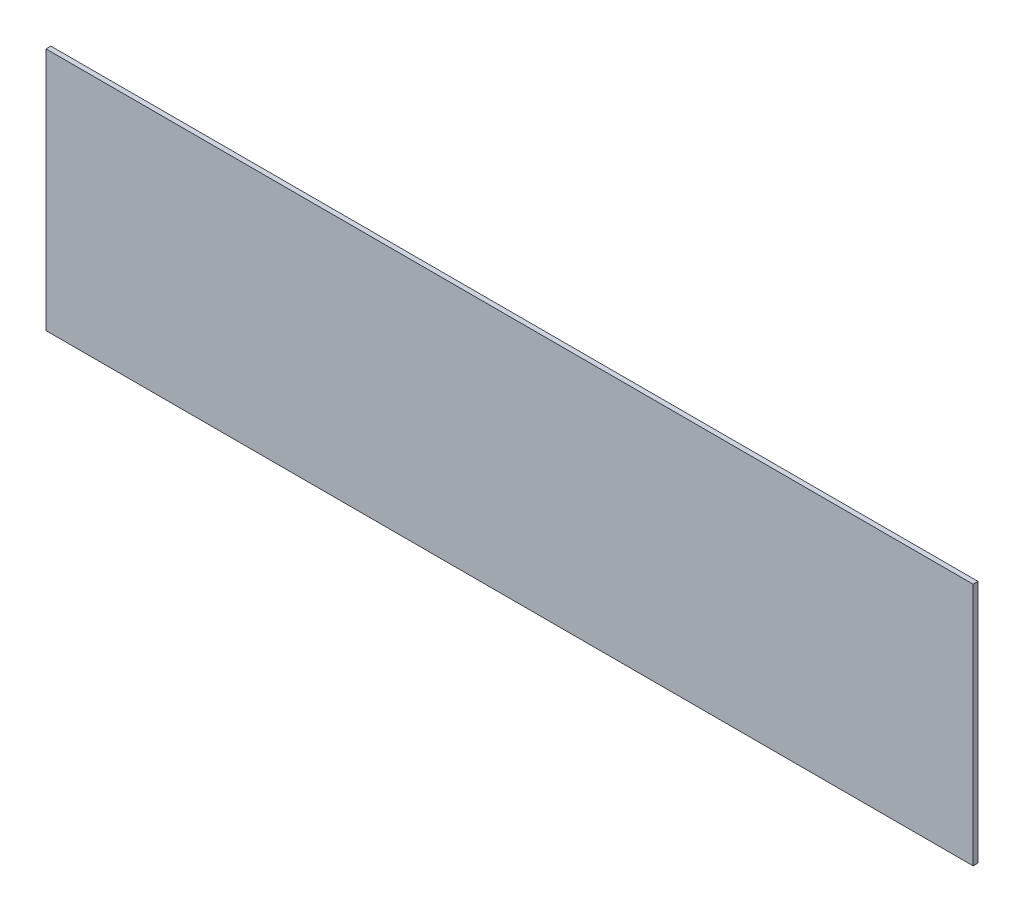
ISO-10303-21;
HEADER;
FILE_DESCRIPTION(('STEP AP214'),'2;1');
FILE_NAME('part.step','',(''),(''),'','','');
FILE_SCHEMA(('AUTOMOTIVE_DESIGN { 1 0 10303 214 1 1 1 1 }'));
ENDSEC;
DATA;
#1=APPLICATION_CONTEXT('core data for automotive mechanical design processes');
#2=APPLICATION_PROTOCOL_DEFINITION('international standard','automotive_design',2000,#1);
#3=PRODUCT_CONTEXT('',#1,'mechanical');
#4=PRODUCT('Part','Part','',(#3));
#5=PRODUCT_RELATED_PRODUCT_CATEGORY('part','',(#4));
#6=PRODUCT_DEFINITION_FORMATION('','',#4);
#7=PRODUCT_DEFINITION_CONTEXT('part definition',#1,'design');
#8=PRODUCT_DEFINITION('design','',#6,#7);
#9=PRODUCT_DEFINITION_SHAPE('','',#8);
#10=(LENGTH_UNIT() NAMED_UNIT(*) SI_UNIT(.MILLI.,.METRE.));
#11=(NAMED_UNIT(*) PLANE_ANGLE_UNIT() SI_UNIT($,.RADIAN.));
#12=(NAMED_UNIT(*) SI_UNIT($,.STERADIAN.) SOLID_ANGLE_UNIT());
#13=UNCERTAINTY_MEASURE_WITH_UNIT(LENGTH_MEASURE(1.E-05),#10,'distance_accuracy_value','');
#14=(GEOMETRIC_REPRESENTATION_CONTEXT(3) GLOBAL_UNCERTAINTY_ASSIGNED_CONTEXT((#13)) GLOBAL_UNIT_ASSIGNED_CONTEXT((#10,
#11,#12)) REPRESENTATION_CONTEXT('',''));
#15=CARTESIAN_POINT('',(0.,0.,0.));
#16=DIRECTION('',(0.,0.,1.));
#17=DIRECTION('',(1.,0.,0.));
#18=AXIS2_PLACEMENT_3D('',#15,#16,#17);
#19=CARTESIAN_POINT('',(285.,75.,3.));
#20=DIRECTION('',(-1.,0.,0.));
#21=DIRECTION('',(0.,-1.,0.));
#22=AXIS2_PLACEMENT_3D('',#19,#20,#21);
#23=PLANE('',#22);
#24=DIRECTION('',(0.,1.,0.));
#25=VECTOR('',#24,1.);
#26=CARTESIAN_POINT('',(285.,75.,0.));
#27=LINE('',#26,#25);
#28=CARTESIAN_POINT('',(285.,-75.,0.));
#29=VERTEX_POINT('',#28);
#30=CARTESIAN_POINT('',(285.,75.,0.));
#31=VERTEX_POINT('',#30);
#32=EDGE_CURVE('E95',#29,#31,#27,.T.);
#33=ORIENTED_EDGE('',*,*,#32,.T.);
#34=DIRECTION('',(0.,0.,-1.));
#35=VECTOR('',#34,1.);
#36=CARTESIAN_POINT('',(285.,75.,3.));
#37=LINE('',#36,#35);
#38=CARTESIAN_POINT('',(285.,75.,3.));
#39=VERTEX_POINT('',#38);
#40=EDGE_CURVE('E11',#39,#31,#37,.T.);
#41=ORIENTED_EDGE('',*,*,#40,.F.);
#42=DIRECTION('',(0.,1.,0.));
#43=VECTOR('',#42,1.);
#44=CARTESIAN_POINT('',(285.,75.,3.));
#45=LINE('',#44,#43);
#46=CARTESIAN_POINT('',(285.,-75.,3.));
#47=VERTEX_POINT('',#46);
#48=EDGE_CURVE('E83',#47,#39,#45,.T.);
#49=ORIENTED_EDGE('',*,*,#48,.F.);
#50=DIRECTION('',(0.,0.,-1.));
#51=VECTOR('',#50,1.);
#52=CARTESIAN_POINT('',(285.,-75.,3.));
#53=LINE('',#52,#51);
#54=EDGE_CURVE('E91',#47,#29,#53,.T.);
#55=ORIENTED_EDGE('',*,*,#54,.T.);
#56=EDGE_LOOP('',(#33,#41,#49,#55));
#57=FACE_BOUND('',#56,.T.);
#58=ADVANCED_FACE('F32',(#57),#23,.F.);
#59=CARTESIAN_POINT('',(-285.,75.,3.));
#60=DIRECTION('',(0.,-1.,0.));
#61=DIRECTION('',(0.,0.,-1.));
#62=AXIS2_PLACEMENT_3D('',#59,#60,#61);
#63=PLANE('',#62);
#64=DIRECTION('',(-1.,0.,0.));
#65=VECTOR('',#64,1.);
#66=CARTESIAN_POINT('',(-285.,75.,0.));
#67=LINE('',#66,#65);
#68=CARTESIAN_POINT('',(-285.,75.,0.));
#69=VERTEX_POINT('',#68);
#70=EDGE_CURVE('E87',#31,#69,#67,.T.);
#71=ORIENTED_EDGE('',*,*,#70,.T.);
#72=DIRECTION('',(0.,0.,-1.));
#73=VECTOR('',#72,1.);
#74=CARTESIAN_POINT('',(-285.,75.,3.));
#75=LINE('',#74,#73);
#76=CARTESIAN_POINT('',(-285.,75.,3.));
#77=VERTEX_POINT('',#76);
#78=EDGE_CURVE('E40',#77,#69,#75,.T.);
#79=ORIENTED_EDGE('',*,*,#78,.F.);
#80=DIRECTION('',(-1.,0.,0.));
#81=VECTOR('',#80,1.);
#82=CARTESIAN_POINT('',(-285.,75.,3.));
#83=LINE('',#82,#81);
#84=EDGE_CURVE('E78',#39,#77,#83,.T.);
#85=ORIENTED_EDGE('',*,*,#84,.F.);
#86=ORIENTED_EDGE('',*,*,#40,.T.);
#87=EDGE_LOOP('',(#71,#79,#85,#86));
#88=FACE_BOUND('',#87,.T.);
#89=ADVANCED_FACE('F86',(#88),#63,.F.);
#90=CARTESIAN_POINT('',(-285.,75.,3.));
#91=DIRECTION('',(1.,0.,0.));
#92=DIRECTION('',(0.,1.,0.));
#93=AXIS2_PLACEMENT_3D('',#90,#91,#92);
#94=PLANE('',#93);
#95=DIRECTION('',(0.,-1.,0.));
#96=VECTOR('',#95,1.);
#97=CARTESIAN_POINT('',(-285.,75.,0.));
#98=LINE('',#97,#96);
#99=CARTESIAN_POINT('',(-285.,-75.,0.));
#100=VERTEX_POINT('',#99);
#101=EDGE_CURVE('E65',#69,#100,#98,.T.);
#102=ORIENTED_EDGE('',*,*,#101,.T.);
#103=DIRECTION('',(0.,0.,-1.));
#104=VECTOR('',#103,1.);
#105=CARTESIAN_POINT('',(-285.,-75.,3.));
#106=LINE('',#105,#104);
#107=CARTESIAN_POINT('',(-285.,-75.,3.));
#108=VERTEX_POINT('',#107);
#109=EDGE_CURVE('E88',#108,#100,#106,.T.);
#110=ORIENTED_EDGE('',*,*,#109,.F.);
#111=DIRECTION('',(0.,-1.,0.));
#112=VECTOR('',#111,1.);
#113=CARTESIAN_POINT('',(-285.,75.,3.));
#114=LINE('',#113,#112);
#115=EDGE_CURVE('E81',#77,#108,#114,.T.);
#116=ORIENTED_EDGE('',*,*,#115,.F.);
#117=ORIENTED_EDGE('',*,*,#78,.T.);
#118=EDGE_LOOP('',(#102,#110,#116,#117));
#119=FACE_BOUND('',#118,.T.);
#120=ADVANCED_FACE('F89',(#119),#94,.F.);
#121=CARTESIAN_POINT('',(-285.,-75.,3.));
#122=DIRECTION('',(0.,1.,0.));
#123=DIRECTION('',(0.,0.,1.));
#124=AXIS2_PLACEMENT_3D('',#121,#122,#123);
#125=PLANE('',#124);
#126=DIRECTION('',(1.,0.,0.));
#127=VECTOR('',#126,1.);
#128=CARTESIAN_POINT('',(-285.,-75.,0.));
#129=LINE('',#128,#127);
#130=EDGE_CURVE('E71',#100,#29,#129,.T.);
#131=ORIENTED_EDGE('',*,*,#130,.T.);
#132=ORIENTED_EDGE('',*,*,#54,.F.);
#133=DIRECTION('',(1.,0.,0.));
#134=VECTOR('',#133,1.);
#135=CARTESIAN_POINT('',(-285.,-75.,3.));
#136=LINE('',#135,#134);
#137=EDGE_CURVE('E48',#108,#47,#136,.T.);
#138=ORIENTED_EDGE('',*,*,#137,.F.);
#139=ORIENTED_EDGE('',*,*,#109,.T.);
#140=EDGE_LOOP('',(#131,#132,#138,#139));
#141=FACE_BOUND('',#140,.T.);
#142=ADVANCED_FACE('F102',(#141),#125,.F.);
#143=CARTESIAN_POINT('',(0.,0.,3.));
#144=DIRECTION('',(0.,0.,1.));
#145=DIRECTION('',(1.,0.,0.));
#146=AXIS2_PLACEMENT_3D('',#143,#144,#145);
#147=PLANE('',#146);
#148=ORIENTED_EDGE('',*,*,#48,.T.);
#149=ORIENTED_EDGE('',*,*,#84,.T.);
#150=ORIENTED_EDGE('',*,*,#115,.T.);
#151=ORIENTED_EDGE('',*,*,#137,.T.);
#152=EDGE_LOOP('',(#148,#149,#150,#151));
#153=FACE_BOUND('',#152,.T.);
#154=ADVANCED_FACE('F79',(#153),#147,.T.);
#155=CARTESIAN_POINT('',(0.,0.,0.));
#156=DIRECTION('',(0.,0.,1.));
#157=DIRECTION('',(1.,0.,0.));
#158=AXIS2_PLACEMENT_3D('',#155,#156,#157);
#159=PLANE('',#158);
#160=ORIENTED_EDGE('',*,*,#32,.F.);
#161=ORIENTED_EDGE('',*,*,#130,.F.);
#162=ORIENTED_EDGE('',*,*,#101,.F.);
#163=ORIENTED_EDGE('',*,*,#70,.F.);
#164=EDGE_LOOP('',(#160,#161,#162,#163));
#165=FACE_BOUND('',#164,.T.);
#166=ADVANCED_FACE('F105',(#165),#159,.F.);
#167=CLOSED_SHELL('',(#58,#89,#120,#142,#154,#166));
#168=MANIFOLD_SOLID_BREP('B2',#167);
#169=ADVANCED_BREP_SHAPE_REPRESENTATION('',(#18,#168),#14);
#170=SHAPE_DEFINITION_REPRESENTATION(#9,#169);
ENDSEC;
END-ISO-10303-21;
